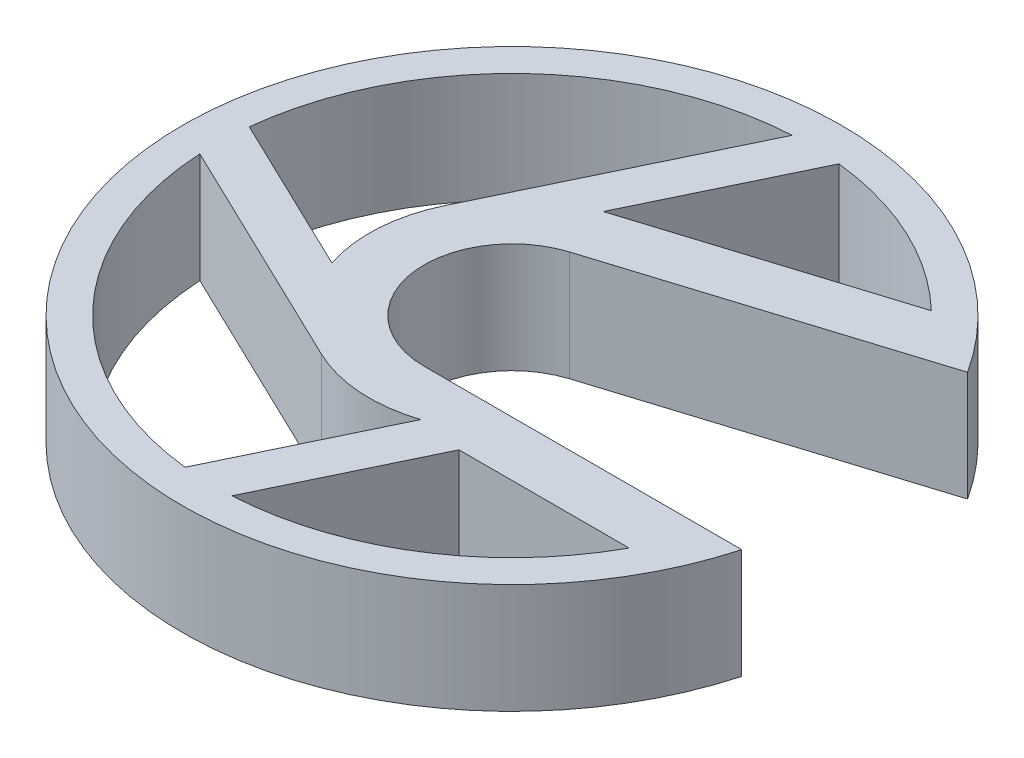
ISO-10303-21;
HEADER;
FILE_DESCRIPTION(('STEP AP214'),'2;1');
FILE_NAME('part.step','',(''),(''),'','','');
FILE_SCHEMA(('AUTOMOTIVE_DESIGN { 1 0 10303 214 1 1 1 1 }'));
ENDSEC;
DATA;
#1=APPLICATION_CONTEXT('core data for automotive mechanical design processes');
#2=APPLICATION_PROTOCOL_DEFINITION('international standard','automotive_design',2000,#1);
#3=PRODUCT_CONTEXT('',#1,'mechanical');
#4=PRODUCT('Part','Part','',(#3));
#5=PRODUCT_RELATED_PRODUCT_CATEGORY('part','',(#4));
#6=PRODUCT_DEFINITION_FORMATION('','',#4);
#7=PRODUCT_DEFINITION_CONTEXT('part definition',#1,'design');
#8=PRODUCT_DEFINITION('design','',#6,#7);
#9=PRODUCT_DEFINITION_SHAPE('','',#8);
#10=(LENGTH_UNIT() NAMED_UNIT(*) SI_UNIT(.MILLI.,.METRE.));
#11=(NAMED_UNIT(*) PLANE_ANGLE_UNIT() SI_UNIT($,.RADIAN.));
#12=(NAMED_UNIT(*) SI_UNIT($,.STERADIAN.) SOLID_ANGLE_UNIT());
#13=UNCERTAINTY_MEASURE_WITH_UNIT(LENGTH_MEASURE(1.E-05),#10,'distance_accuracy_value','');
#14=(GEOMETRIC_REPRESENTATION_CONTEXT(3) GLOBAL_UNCERTAINTY_ASSIGNED_CONTEXT((#13)) GLOBAL_UNIT_ASSIGNED_CONTEXT((#10,
#11,#12)) REPRESENTATION_CONTEXT('',''));
#15=CARTESIAN_POINT('',(0.,0.,0.));
#16=DIRECTION('',(0.,0.,1.));
#17=DIRECTION('',(1.,0.,0.));
#18=AXIS2_PLACEMENT_3D('',#15,#16,#17);
#19=CARTESIAN_POINT('',(-59.407,5.,0.));
#20=DIRECTION('',(0.,-1.,0.));
#21=DIRECTION('',(0.,0.,-1.));
#22=AXIS2_PLACEMENT_3D('',#19,#20,#21);
#23=CYLINDRICAL_SURFACE('',#22,6.5);
#24=CARTESIAN_POINT('',(-59.407,0.,0.));
#25=DIRECTION('',(0.,1.,0.));
#26=DIRECTION('',(0.,0.,1.));
#27=AXIS2_PLACEMENT_3D('',#24,#25,#26);
#28=CIRCLE('',#27,6.5);
#29=CARTESIAN_POINT('',(-65.2650191949915,0.,-2.81666666666666));
#30=VERTEX_POINT('',#29);
#31=CARTESIAN_POINT('',(-65.5841608543902,0.,2.02303825445523));
#32=VERTEX_POINT('',#31);
#33=EDGE_CURVE('E226',#30,#32,#28,.T.);
#34=ORIENTED_EDGE('',*,*,#33,.T.);
#35=DIRECTION('',(0.,-1.,0.));
#36=VECTOR('',#35,1.);
#37=CARTESIAN_POINT('',(-65.5841608543902,5.,2.02303825445523));
#38=LINE('',#37,#36);
#39=CARTESIAN_POINT('',(-65.5841608543902,5.,2.02303825445523));
#40=VERTEX_POINT('',#39);
#41=EDGE_CURVE('E11',#40,#32,#38,.T.);
#42=ORIENTED_EDGE('',*,*,#41,.F.);
#43=CARTESIAN_POINT('',(-59.407,5.,0.));
#44=DIRECTION('',(0.,1.,0.));
#45=DIRECTION('',(0.,0.,1.));
#46=AXIS2_PLACEMENT_3D('',#43,#44,#45);
#47=CIRCLE('',#46,6.5);
#48=CARTESIAN_POINT('',(-65.2650191949915,5.,-2.81666666666666));
#49=VERTEX_POINT('',#48);
#50=EDGE_CURVE('E189',#49,#40,#47,.T.);
#51=ORIENTED_EDGE('',*,*,#50,.F.);
#52=DIRECTION('',(0.,-1.,0.));
#53=VECTOR('',#52,1.);
#54=CARTESIAN_POINT('',(-65.2650191949915,5.,-2.81666666666666));
#55=LINE('',#54,#53);
#56=EDGE_CURVE('E55',#49,#30,#55,.T.);
#57=ORIENTED_EDGE('',*,*,#56,.T.);
#58=EDGE_LOOP('',(#34,#42,#51,#57));
#59=FACE_BOUND('',#58,.T.);
#60=ADVANCED_FACE('F36',(#59),#23,.T.);
#61=CARTESIAN_POINT('',(-13.1053144444444,5.,27.256041504836));
#62=DIRECTION('',(0.433333333333332,0.,-0.901233722306385));
#63=DIRECTION('',(-0.901233722306385,0.,-0.433333333333332));
#64=AXIS2_PLACEMENT_3D('',#61,#62,#63);
#65=PLANE('',#64);
#66=DIRECTION('',(0.901233722306386,0.,0.433333333333332));
#67=VECTOR('',#66,1.);
#68=CARTESIAN_POINT('',(-13.1053144444444,0.,27.256041504836));
#69=LINE('',#68,#67);
#70=CARTESIAN_POINT('',(-72.8278325765831,0.,-1.45988114287635));
#71=VERTEX_POINT('',#70);
#72=EDGE_CURVE('E179',#71,#32,#69,.T.);
#73=ORIENTED_EDGE('',*,*,#72,.F.);
#74=DIRECTION('',(0.,-1.,0.));
#75=VECTOR('',#74,1.);
#76=CARTESIAN_POINT('',(-72.8278325765831,5.,-1.45988114287635));
#77=LINE('',#76,#75);
#78=CARTESIAN_POINT('',(-72.8278325765831,5.,-1.45988114287635));
#79=VERTEX_POINT('',#78);
#80=EDGE_CURVE('E46',#79,#71,#77,.T.);
#81=ORIENTED_EDGE('',*,*,#80,.F.);
#82=DIRECTION('',(0.901233722306386,0.,0.433333333333332));
#83=VECTOR('',#82,1.);
#84=CARTESIAN_POINT('',(-13.1053144444444,5.,27.256041504836));
#85=LINE('',#84,#83);
#86=EDGE_CURVE('E177',#79,#40,#85,.T.);
#87=ORIENTED_EDGE('',*,*,#86,.T.);
#88=ORIENTED_EDGE('',*,*,#41,.T.);
#89=EDGE_LOOP('',(#73,#81,#87,#88));
#90=FACE_BOUND('',#89,.T.);
#91=ADVANCED_FACE('F176',(#90),#65,.T.);
#92=CARTESIAN_POINT('',(-59.407,5.,0.));
#93=DIRECTION('',(0.,-1.,0.));
#94=DIRECTION('',(0.,0.,-1.));
#95=AXIS2_PLACEMENT_3D('',#92,#93,#94);
#96=CYLINDRICAL_SURFACE('',#95,13.5);
#97=CARTESIAN_POINT('',(-59.407,0.,0.));
#98=DIRECTION('',(0.,1.,0.));
#99=DIRECTION('',(0.,0.,1.));
#100=AXIS2_PLACEMENT_3D('',#97,#98,#99);
#101=CIRCLE('',#100,13.5);
#102=CARTESIAN_POINT('',(-60.1377500496385,0.,-13.4802078754355));
#103=VERTEX_POINT('',#102);
#104=EDGE_CURVE('E243',#103,#71,#101,.T.);
#105=ORIENTED_EDGE('',*,*,#104,.F.);
#106=DIRECTION('',(0.,-1.,0.));
#107=VECTOR('',#106,1.);
#108=CARTESIAN_POINT('',(-60.1377500496385,5.,-13.4802078754355));
#109=LINE('',#108,#107);
#110=CARTESIAN_POINT('',(-60.1377500496385,5.,-13.4802078754355));
#111=VERTEX_POINT('',#110);
#112=EDGE_CURVE('E113',#111,#103,#109,.T.);
#113=ORIENTED_EDGE('',*,*,#112,.F.);
#114=CARTESIAN_POINT('',(-59.407,5.,0.));
#115=DIRECTION('',(0.,1.,0.));
#116=DIRECTION('',(0.,0.,1.));
#117=AXIS2_PLACEMENT_3D('',#114,#115,#116);
#118=CIRCLE('',#117,13.5);
#119=EDGE_CURVE('E188',#111,#79,#118,.T.);
#120=ORIENTED_EDGE('',*,*,#119,.T.);
#121=ORIENTED_EDGE('',*,*,#80,.T.);
#122=EDGE_LOOP('',(#105,#113,#120,#121));
#123=FACE_BOUND('',#122,.T.);
#124=ADVANCED_FACE('F192',(#123),#96,.F.);
#125=CARTESIAN_POINT('',(-7.23473802794314,5.,-23.1295921873866));
#126=DIRECTION('',(-0.298528370942468,0.,-0.954400760552105));
#127=DIRECTION('',(-0.954400760552105,0.,0.298528370942468));
#128=AXIS2_PLACEMENT_3D('',#125,#126,#127);
#129=PLANE('',#128);
#130=DIRECTION('',(0.954400760552105,0.,-0.298528370942468));
#131=VECTOR('',#130,1.);
#132=CARTESIAN_POINT('',(-7.23473802794314,0.,-23.1295921873866));
#133=LINE('',#132,#131);
#134=CARTESIAN_POINT('',(-61.347434411126,0.,-6.20360494358868));
#135=VERTEX_POINT('',#134);
#136=CARTESIAN_POINT('',(-50.0548123221716,0.,-9.73584026361747));
#137=VERTEX_POINT('',#136);
#138=EDGE_CURVE('E233',#135,#137,#133,.T.);
#139=ORIENTED_EDGE('',*,*,#138,.F.);
#140=DIRECTION('',(0.,-1.,0.));
#141=VECTOR('',#140,1.);
#142=CARTESIAN_POINT('',(-61.347434411126,5.,-6.20360494358868));
#143=LINE('',#142,#141);
#144=CARTESIAN_POINT('',(-61.347434411126,5.,-6.20360494358868));
#145=VERTEX_POINT('',#144);
#146=EDGE_CURVE('E249',#145,#135,#143,.T.);
#147=ORIENTED_EDGE('',*,*,#146,.F.);
#148=DIRECTION('',(0.954400760552105,0.,-0.298528370942468));
#149=VECTOR('',#148,1.);
#150=CARTESIAN_POINT('',(-7.23473802794314,5.,-23.1295921873866));
#151=LINE('',#150,#149);
#152=CARTESIAN_POINT('',(-50.0548123221716,5.,-9.73584026361747));
#153=VERTEX_POINT('',#152);
#154=EDGE_CURVE('E324',#145,#153,#151,.T.);
#155=ORIENTED_EDGE('',*,*,#154,.T.);
#156=DIRECTION('',(0.,-1.,0.));
#157=VECTOR('',#156,1.);
#158=CARTESIAN_POINT('',(-50.0548123221716,5.,-9.73584026361747));
#159=LINE('',#158,#157);
#160=EDGE_CURVE('E251',#153,#137,#159,.T.);
#161=ORIENTED_EDGE('',*,*,#160,.T.);
#162=EDGE_LOOP('',(#139,#147,#155,#161));
#163=FACE_BOUND('',#162,.T.);
#164=ADVANCED_FACE('F351',(#163),#129,.T.);
#165=CARTESIAN_POINT('',(-61.4300382544552,0.,-6.17716085439021));
#166=VERTEX_POINT('',#165);
#167=EDGE_CURVE('E227',#135,#166,#28,.T.);
#168=ORIENTED_EDGE('',*,*,#167,.T.);
#169=DIRECTION('',(0.,-1.,0.));
#170=VECTOR('',#169,1.);
#171=CARTESIAN_POINT('',(-61.4300382544552,5.,-6.17716085439021));
#172=LINE('',#171,#170);
#173=CARTESIAN_POINT('',(-61.4300382544552,5.,-6.17716085439021));
#174=VERTEX_POINT('',#173);
#175=EDGE_CURVE('E256',#174,#166,#172,.T.);
#176=ORIENTED_EDGE('',*,*,#175,.F.);
#177=EDGE_CURVE('E318',#145,#174,#47,.T.);
#178=ORIENTED_EDGE('',*,*,#177,.F.);
#179=ORIENTED_EDGE('',*,*,#146,.T.);
#180=EDGE_LOOP('',(#168,#176,#178,#179));
#181=FACE_BOUND('',#180,.T.);
#182=ADVANCED_FACE('F340',(#181),#23,.T.);
#183=CARTESIAN_POINT('',(-52.3072373059343,5.,-25.1504897544573));
#184=DIRECTION('',(0.901233722306385,0.,0.433333333333333));
#185=DIRECTION('',(0.433333333333333,0.,-0.901233722306385));
#186=AXIS2_PLACEMENT_3D('',#183,#184,#185);
#187=PLANE('',#186);
#188=DIRECTION('',(-0.433333333333333,0.,0.901233722306385));
#189=VECTOR('',#188,1.);
#190=CARTESIAN_POINT('',(-52.3072373059343,0.,-25.1504897544573));
#191=LINE('',#190,#189);
#192=CARTESIAN_POINT('',(-57.9471188571237,0.,-13.4208325765831));
#193=VERTEX_POINT('',#192);
#194=EDGE_CURVE('E236',#193,#166,#191,.T.);
#195=ORIENTED_EDGE('',*,*,#194,.F.);
#196=DIRECTION('',(0.,-1.,0.));
#197=VECTOR('',#196,1.);
#198=CARTESIAN_POINT('',(-57.9471188571237,5.,-13.4208325765831));
#199=LINE('',#198,#197);
#200=CARTESIAN_POINT('',(-57.9471188571237,5.,-13.4208325765831));
#201=VERTEX_POINT('',#200);
#202=EDGE_CURVE('E253',#201,#193,#199,.T.);
#203=ORIENTED_EDGE('',*,*,#202,.F.);
#204=DIRECTION('',(-0.433333333333333,0.,0.901233722306385));
#205=VECTOR('',#204,1.);
#206=CARTESIAN_POINT('',(-52.3072373059343,5.,-25.1504897544573));
#207=LINE('',#206,#205);
#208=EDGE_CURVE('E327',#201,#174,#207,.T.);
#209=ORIENTED_EDGE('',*,*,#208,.T.);
#210=ORIENTED_EDGE('',*,*,#175,.T.);
#211=EDGE_LOOP('',(#195,#203,#209,#210));
#212=FACE_BOUND('',#211,.T.);
#213=ADVANCED_FACE('F344',(#212),#187,.T.);
#214=CARTESIAN_POINT('',(-13.9719811111111,5.,29.0585089494489));
#215=DIRECTION('',(-0.433333333333334,0.,0.901233722306385));
#216=DIRECTION('',(0.901233722306385,0.,0.433333333333334));
#217=AXIS2_PLACEMENT_3D('',#214,#215,#216);
#218=PLANE('',#217);
#219=DIRECTION('',(-0.901233722306385,0.,-0.433333333333334));
#220=VECTOR('',#219,1.);
#221=CARTESIAN_POINT('',(-13.9719811111111,0.,29.0585089494489));
#222=LINE('',#221,#220);
#223=CARTESIAN_POINT('',(-62.2236666666667,0.,5.85801919499151));
#224=VERTEX_POINT('',#223);
#225=CARTESIAN_POINT('',(-72.8872078754355,0.,0.730750049638505));
#226=VERTEX_POINT('',#225);
#227=EDGE_CURVE('E219',#224,#226,#222,.T.);
#228=ORIENTED_EDGE('',*,*,#227,.F.);
#229=DIRECTION('',(0.,-1.,0.));
#230=VECTOR('',#229,1.);
#231=CARTESIAN_POINT('',(-62.2236666666667,5.,5.85801919499151));
#232=LINE('',#231,#230);
#233=CARTESIAN_POINT('',(-62.2236666666667,5.,5.85801919499151));
#234=VERTEX_POINT('',#233);
#235=EDGE_CURVE('E254',#234,#224,#232,.T.);
#236=ORIENTED_EDGE('',*,*,#235,.F.);
#237=DIRECTION('',(-0.901233722306385,0.,-0.433333333333334));
#238=VECTOR('',#237,1.);
#239=CARTESIAN_POINT('',(-13.9719811111111,5.,29.0585089494489));
#240=LINE('',#239,#238);
#241=CARTESIAN_POINT('',(-72.8872078754355,5.,0.730750049638505));
#242=VERTEX_POINT('',#241);
#243=EDGE_CURVE('E312',#234,#242,#240,.T.);
#244=ORIENTED_EDGE('',*,*,#243,.T.);
#245=DIRECTION('',(0.,-1.,0.));
#246=VECTOR('',#245,1.);
#247=CARTESIAN_POINT('',(-72.8872078754355,5.,0.730750049638505));
#248=LINE('',#247,#246);
#249=EDGE_CURVE('E259',#242,#226,#248,.T.);
#250=ORIENTED_EDGE('',*,*,#249,.T.);
#251=EDGE_LOOP('',(#228,#236,#244,#250));
#252=FACE_BOUND('',#251,.T.);
#253=ADVANCED_FACE('F371',(#252),#218,.T.);
#254=CARTESIAN_POINT('',(-57.3839617455447,0.,6.1771608543902));
#255=VERTEX_POINT('',#254);
#256=EDGE_CURVE('E222',#224,#255,#28,.T.);
#257=ORIENTED_EDGE('',*,*,#256,.T.);
#258=DIRECTION('',(0.,-1.,0.));
#259=VECTOR('',#258,1.);
#260=CARTESIAN_POINT('',(-57.3839617455447,5.,6.1771608543902));
#261=LINE('',#260,#259);
#262=CARTESIAN_POINT('',(-57.3839617455447,5.,6.1771608543902));
#263=VERTEX_POINT('',#262);
#264=EDGE_CURVE('E264',#263,#255,#261,.T.);
#265=ORIENTED_EDGE('',*,*,#264,.F.);
#266=EDGE_CURVE('E315',#234,#263,#47,.T.);
#267=ORIENTED_EDGE('',*,*,#266,.F.);
#268=ORIENTED_EDGE('',*,*,#235,.T.);
#269=EDGE_LOOP('',(#257,#265,#267,#268));
#270=FACE_BOUND('',#269,.T.);
#271=ADVANCED_FACE('F359',(#270),#23,.T.);
#272=CARTESIAN_POINT('',(-44.1961338051768,5.,-21.2504897544573));
#273=DIRECTION('',(-0.901233722306385,0.,-0.433333333333333));
#274=DIRECTION('',(-0.433333333333333,0.,0.901233722306385));
#275=AXIS2_PLACEMENT_3D('',#272,#273,#274);
#276=PLANE('',#275);
#277=DIRECTION('',(0.433333333333333,0.,-0.901233722306385));
#278=VECTOR('',#277,1.);
#279=CARTESIAN_POINT('',(-44.1961338051768,0.,-21.2504897544573));
#280=LINE('',#279,#278);
#281=CARTESIAN_POINT('',(-60.8668811428763,0.,13.4208325765831));
#282=VERTEX_POINT('',#281);
#283=EDGE_CURVE('E225',#282,#255,#280,.T.);
#284=ORIENTED_EDGE('',*,*,#283,.F.);
#285=DIRECTION('',(0.,-1.,0.));
#286=VECTOR('',#285,1.);
#287=CARTESIAN_POINT('',(-60.8668811428763,5.,13.4208325765831));
#288=LINE('',#287,#286);
#289=CARTESIAN_POINT('',(-60.8668811428763,5.,13.4208325765831));
#290=VERTEX_POINT('',#289);
#291=EDGE_CURVE('E261',#290,#282,#288,.T.);
#292=ORIENTED_EDGE('',*,*,#291,.F.);
#293=DIRECTION('',(0.433333333333333,0.,-0.901233722306385));
#294=VECTOR('',#293,1.);
#295=CARTESIAN_POINT('',(-44.1961338051768,5.,-21.2504897544573));
#296=LINE('',#295,#294);
#297=EDGE_CURVE('E317',#290,#263,#296,.T.);
#298=ORIENTED_EDGE('',*,*,#297,.T.);
#299=ORIENTED_EDGE('',*,*,#264,.T.);
#300=EDGE_LOOP('',(#284,#292,#298,#299));
#301=FACE_BOUND('',#300,.T.);
#302=ADVANCED_FACE('F370',(#301),#276,.T.);
#303=CARTESIAN_POINT('',(-59.407,5.,0.));
#304=DIRECTION('',(0.,-1.,0.));
#305=DIRECTION('',(0.,0.,-1.));
#306=AXIS2_PLACEMENT_3D('',#303,#304,#305);
#307=CYLINDRICAL_SURFACE('',#306,13.5);
#308=CARTESIAN_POINT('',(-59.407,0.,0.));
#309=DIRECTION('',(0.,1.,0.));
#310=DIRECTION('',(0.,0.,1.));
#311=AXIS2_PLACEMENT_3D('',#308,#309,#310);
#312=CIRCLE('',#311,13.5);
#313=CARTESIAN_POINT('',(-58.6762499503615,0.,13.4802078754355));
#314=VERTEX_POINT('',#313);
#315=CARTESIAN_POINT('',(-47.5748404338008,0.,6.5));
#316=VERTEX_POINT('',#315);
#317=EDGE_CURVE('E210',#314,#316,#312,.T.);
#318=ORIENTED_EDGE('',*,*,#317,.F.);
#319=DIRECTION('',(0.,-1.,0.));
#320=VECTOR('',#319,1.);
#321=CARTESIAN_POINT('',(-58.6762499503615,5.,13.4802078754355));
#322=LINE('',#321,#320);
#323=CARTESIAN_POINT('',(-58.6762499503615,5.,13.4802078754355));
#324=VERTEX_POINT('',#323);
#325=EDGE_CURVE('E262',#324,#314,#322,.T.);
#326=ORIENTED_EDGE('',*,*,#325,.F.);
#327=CARTESIAN_POINT('',(-59.407,5.,0.));
#328=DIRECTION('',(0.,1.,0.));
#329=DIRECTION('',(0.,0.,1.));
#330=AXIS2_PLACEMENT_3D('',#327,#328,#329);
#331=CIRCLE('',#330,13.5);
#332=CARTESIAN_POINT('',(-47.5748404338008,5.,6.5));
#333=VERTEX_POINT('',#332);
#334=EDGE_CURVE('E298',#324,#333,#331,.T.);
#335=ORIENTED_EDGE('',*,*,#334,.T.);
#336=DIRECTION('',(0.,-1.,0.));
#337=VECTOR('',#336,1.);
#338=CARTESIAN_POINT('',(-47.5748404338008,5.,6.5));
#339=LINE('',#338,#337);
#340=EDGE_CURVE('E267',#333,#316,#339,.T.);
#341=ORIENTED_EDGE('',*,*,#340,.T.);
#342=EDGE_LOOP('',(#318,#326,#335,#341));
#343=FACE_BOUND('',#342,.T.);
#344=ADVANCED_FACE('F377',(#343),#307,.F.);
#345=CARTESIAN_POINT('',(-42.3936663605641,5.,-20.3838230877907));
#346=DIRECTION('',(0.901233722306385,0.,0.433333333333333));
#347=DIRECTION('',(0.433333333333333,0.,-0.901233722306385));
#348=AXIS2_PLACEMENT_3D('',#345,#346,#347);
#349=PLANE('',#348);
#350=DIRECTION('',(-0.433333333333333,0.,0.901233722306385));
#351=VECTOR('',#350,1.);
#352=CARTESIAN_POINT('',(-42.3936663605641,0.,-20.3838230877907));
#353=LINE('',#352,#351);
#354=CARTESIAN_POINT('',(-55.3200098639594,0.,6.5));
#355=VERTEX_POINT('',#354);
#356=EDGE_CURVE('E213',#355,#314,#353,.T.);
#357=ORIENTED_EDGE('',*,*,#356,.F.);
#358=DIRECTION('',(0.,-1.,0.));
#359=VECTOR('',#358,1.);
#360=CARTESIAN_POINT('',(-55.3200098639594,5.,6.5));
#361=LINE('',#360,#359);
#362=CARTESIAN_POINT('',(-55.3200098639594,5.,6.5));
#363=VERTEX_POINT('',#362);
#364=EDGE_CURVE('E269',#363,#355,#361,.T.);
#365=ORIENTED_EDGE('',*,*,#364,.F.);
#366=DIRECTION('',(-0.433333333333333,0.,0.901233722306385));
#367=VECTOR('',#366,1.);
#368=CARTESIAN_POINT('',(-42.3936663605641,5.,-20.3838230877907));
#369=LINE('',#368,#367);
#370=EDGE_CURVE('E307',#363,#324,#369,.T.);
#371=ORIENTED_EDGE('',*,*,#370,.T.);
#372=ORIENTED_EDGE('',*,*,#325,.T.);
#373=EDGE_LOOP('',(#357,#365,#371,#372));
#374=FACE_BOUND('',#373,.T.);
#375=ADVANCED_FACE('F404',(#374),#349,.T.);
#376=CARTESIAN_POINT('',(-59.407,5.,0.));
#377=DIRECTION('',(0.,-1.,0.));
#378=DIRECTION('',(0.,0.,-1.));
#379=AXIS2_PLACEMENT_3D('',#376,#377,#378);
#380=CYLINDRICAL_SURFACE('',#379,15.);
#381=CARTESIAN_POINT('',(-59.407,0.,0.));
#382=DIRECTION('',(0.,1.,0.));
#383=DIRECTION('',(0.,0.,1.));
#384=AXIS2_PLACEMENT_3D('',#381,#382,#383);
#385=CIRCLE('',#384,15.);
#386=CARTESIAN_POINT('',(-46.8035017464376,0.,-8.13337763616382));
#387=VERTEX_POINT('',#386);
#388=CARTESIAN_POINT('',(-44.950167705199,0.,4.00000000000001));
#389=VERTEX_POINT('',#388);
#390=EDGE_CURVE('E199',#387,#389,#385,.T.);
#391=ORIENTED_EDGE('',*,*,#390,.T.);
#392=DIRECTION('',(0.,-1.,0.));
#393=VECTOR('',#392,1.);
#394=CARTESIAN_POINT('',(-44.950167705199,5.,4.00000000000001));
#395=LINE('',#394,#393);
#396=CARTESIAN_POINT('',(-44.950167705199,5.,4.00000000000001));
#397=VERTEX_POINT('',#396);
#398=EDGE_CURVE('E40',#397,#389,#395,.T.);
#399=ORIENTED_EDGE('',*,*,#398,.F.);
#400=CARTESIAN_POINT('',(-59.407,5.,0.));
#401=DIRECTION('',(0.,1.,0.));
#402=DIRECTION('',(0.,0.,1.));
#403=AXIS2_PLACEMENT_3D('',#400,#401,#402);
#404=CIRCLE('',#403,15.);
#405=CARTESIAN_POINT('',(-46.8035017464376,5.,-8.13337763616382));
#406=VERTEX_POINT('',#405);
#407=EDGE_CURVE('E126',#406,#397,#404,.T.);
#408=ORIENTED_EDGE('',*,*,#407,.F.);
#409=DIRECTION('',(0.,-1.,0.));
#410=VECTOR('',#409,1.);
#411=CARTESIAN_POINT('',(-46.8035017464376,5.,-8.13337763616382));
#412=LINE('',#411,#410);
#413=EDGE_CURVE('E195',#406,#387,#412,.T.);
#414=ORIENTED_EDGE('',*,*,#413,.T.);
#415=EDGE_LOOP('',(#391,#399,#408,#414));
#416=FACE_BOUND('',#415,.T.);
#417=ADVANCED_FACE('F38',(#416),#380,.T.);
#418=CARTESIAN_POINT('',(0.,5.,4.00000000000001));
#419=DIRECTION('',(0.,0.,-1.));
#420=DIRECTION('',(-1.,0.,0.));
#421=AXIS2_PLACEMENT_3D('',#418,#419,#420);
#422=PLANE('',#421);
#423=DIRECTION('',(1.,0.,0.));
#424=VECTOR('',#423,1.);
#425=CARTESIAN_POINT('',(0.,0.,4.00000000000001));
#426=LINE('',#425,#424);
#427=CARTESIAN_POINT('',(-59.407,0.,4.00000000000001));
#428=VERTEX_POINT('',#427);
#429=EDGE_CURVE('E202',#428,#389,#426,.T.);
#430=ORIENTED_EDGE('',*,*,#429,.F.);
#431=DIRECTION('',(0.,-1.,0.));
#432=VECTOR('',#431,1.);
#433=CARTESIAN_POINT('',(-59.407,5.,4.00000000000001));
#434=LINE('',#433,#432);
#435=CARTESIAN_POINT('',(-59.407,5.,4.00000000000001));
#436=VERTEX_POINT('',#435);
#437=EDGE_CURVE('E275',#436,#428,#434,.T.);
#438=ORIENTED_EDGE('',*,*,#437,.F.);
#439=DIRECTION('',(1.,0.,0.));
#440=VECTOR('',#439,1.);
#441=CARTESIAN_POINT('',(0.,5.,4.00000000000001));
#442=LINE('',#441,#440);
#443=EDGE_CURVE('E283',#436,#397,#442,.T.);
#444=ORIENTED_EDGE('',*,*,#443,.T.);
#445=ORIENTED_EDGE('',*,*,#398,.T.);
#446=EDGE_LOOP('',(#430,#438,#444,#445));
#447=FACE_BOUND('',#446,.T.);
#448=ADVANCED_FACE('F282',(#447),#422,.T.);
#449=CARTESIAN_POINT('',(-59.407,5.,0.));
#450=DIRECTION('',(0.,-1.,0.));
#451=DIRECTION('',(0.,0.,-1.));
#452=AXIS2_PLACEMENT_3D('',#449,#450,#451);
#453=CYLINDRICAL_SURFACE('',#452,4.00000000000001);
#454=CARTESIAN_POINT('',(-59.407,0.,0.));
#455=DIRECTION('',(0.,1.,0.));
#456=DIRECTION('',(0.,0.,1.));
#457=AXIS2_PLACEMENT_3D('',#454,#455,#456);
#458=CIRCLE('',#457,4.00000000000001);
#459=CARTESIAN_POINT('',(-60.6011134837699,0.,-3.81760304220843));
#460=VERTEX_POINT('',#459);
#461=EDGE_CURVE('E205',#460,#428,#458,.T.);
#462=ORIENTED_EDGE('',*,*,#461,.F.);
#463=DIRECTION('',(0.,-1.,0.));
#464=VECTOR('',#463,1.);
#465=CARTESIAN_POINT('',(-60.6011134837699,5.,-3.81760304220843));
#466=LINE('',#465,#464);
#467=CARTESIAN_POINT('',(-60.6011134837699,5.,-3.81760304220843));
#468=VERTEX_POINT('',#467);
#469=EDGE_CURVE('E274',#468,#460,#466,.T.);
#470=ORIENTED_EDGE('',*,*,#469,.F.);
#471=CARTESIAN_POINT('',(-59.407,5.,0.));
#472=DIRECTION('',(0.,1.,0.));
#473=DIRECTION('',(0.,0.,1.));
#474=AXIS2_PLACEMENT_3D('',#471,#472,#473);
#475=CIRCLE('',#474,4.00000000000001);
#476=EDGE_CURVE('E294',#468,#436,#475,.T.);
#477=ORIENTED_EDGE('',*,*,#476,.T.);
#478=ORIENTED_EDGE('',*,*,#437,.T.);
#479=EDGE_LOOP('',(#462,#470,#477,#478));
#480=FACE_BOUND('',#479,.T.);
#481=ADVANCED_FACE('F291',(#480),#453,.F.);
#482=CARTESIAN_POINT('',(-59.407,5.,0.));
#483=DIRECTION('',(0.,-1.,0.));
#484=DIRECTION('',(0.,0.,-1.));
#485=AXIS2_PLACEMENT_3D('',#482,#483,#484);
#486=CYLINDRICAL_SURFACE('',#485,13.5);
#487=CARTESIAN_POINT('',(-59.407,0.,0.));
#488=DIRECTION('',(0.,1.,0.));
#489=DIRECTION('',(0.,0.,1.));
#490=AXIS2_PLACEMENT_3D('',#487,#488,#489);
#491=CIRCLE('',#490,13.5);
#492=EDGE_CURVE('E239',#137,#193,#491,.T.);
#493=ORIENTED_EDGE('',*,*,#492,.F.);
#494=ORIENTED_EDGE('',*,*,#160,.F.);
#495=CARTESIAN_POINT('',(-59.407,5.,0.));
#496=DIRECTION('',(0.,1.,0.));
#497=DIRECTION('',(0.,0.,1.));
#498=AXIS2_PLACEMENT_3D('',#495,#496,#497);
#499=CIRCLE('',#498,13.5);
#500=EDGE_CURVE('E329',#153,#201,#499,.T.);
#501=ORIENTED_EDGE('',*,*,#500,.T.);
#502=ORIENTED_EDGE('',*,*,#202,.T.);
#503=EDGE_LOOP('',(#493,#494,#501,#502));
#504=FACE_BOUND('',#503,.T.);
#505=ADVANCED_FACE('F346',(#504),#486,.F.);
#506=CARTESIAN_POINT('',(-59.407,5.,0.));
#507=DIRECTION('',(0.,-1.,0.));
#508=DIRECTION('',(0.,0.,-1.));
#509=AXIS2_PLACEMENT_3D('',#506,#507,#508);
#510=CYLINDRICAL_SURFACE('',#509,13.5);
#511=CARTESIAN_POINT('',(-59.407,0.,0.));
#512=DIRECTION('',(0.,1.,0.));
#513=DIRECTION('',(0.,0.,1.));
#514=AXIS2_PLACEMENT_3D('',#511,#512,#513);
#515=CIRCLE('',#514,13.5);
#516=EDGE_CURVE('E230',#226,#282,#515,.T.);
#517=ORIENTED_EDGE('',*,*,#516,.F.);
#518=ORIENTED_EDGE('',*,*,#249,.F.);
#519=CARTESIAN_POINT('',(-59.407,5.,0.));
#520=DIRECTION('',(0.,1.,0.));
#521=DIRECTION('',(0.,0.,1.));
#522=AXIS2_PLACEMENT_3D('',#519,#520,#521);
#523=CIRCLE('',#522,13.5);
#524=EDGE_CURVE('E321',#242,#290,#523,.T.);
#525=ORIENTED_EDGE('',*,*,#524,.T.);
#526=ORIENTED_EDGE('',*,*,#291,.T.);
#527=EDGE_LOOP('',(#517,#518,#525,#526));
#528=FACE_BOUND('',#527,.T.);
#529=ADVANCED_FACE('F394',(#528),#510,.F.);
#530=CARTESIAN_POINT('',(0.,5.,6.5));
#531=DIRECTION('',(0.,0.,-1.));
#532=DIRECTION('',(-1.,0.,0.));
#533=AXIS2_PLACEMENT_3D('',#530,#531,#532);
#534=PLANE('',#533);
#535=DIRECTION('',(1.,0.,0.));
#536=VECTOR('',#535,1.);
#537=CARTESIAN_POINT('',(0.,0.,6.5));
#538=LINE('',#537,#536);
#539=EDGE_CURVE('E216',#355,#316,#538,.T.);
#540=ORIENTED_EDGE('',*,*,#539,.T.);
#541=ORIENTED_EDGE('',*,*,#340,.F.);
#542=DIRECTION('',(1.,0.,0.));
#543=VECTOR('',#542,1.);
#544=CARTESIAN_POINT('',(0.,5.,6.5));
#545=LINE('',#544,#543);
#546=EDGE_CURVE('E310',#363,#333,#545,.T.);
#547=ORIENTED_EDGE('',*,*,#546,.F.);
#548=ORIENTED_EDGE('',*,*,#364,.T.);
#549=EDGE_LOOP('',(#540,#541,#547,#548));
#550=FACE_BOUND('',#549,.T.);
#551=ADVANCED_FACE('F396',(#550),#534,.F.);
#552=CARTESIAN_POINT('',(-6.48841710058697,5.,-20.7435902860064));
#553=DIRECTION('',(-0.298528370942468,0.,-0.954400760552105));
#554=DIRECTION('',(-0.954400760552105,0.,0.298528370942468));
#555=AXIS2_PLACEMENT_3D('',#552,#553,#554);
#556=PLANE('',#555);
#557=DIRECTION('',(0.954400760552105,0.,-0.298528370942468));
#558=VECTOR('',#557,1.);
#559=CARTESIAN_POINT('',(-6.48841710058697,0.,-20.7435902860064));
#560=LINE('',#559,#558);
#561=EDGE_CURVE('E208',#460,#387,#560,.T.);
#562=ORIENTED_EDGE('',*,*,#561,.T.);
#563=ORIENTED_EDGE('',*,*,#413,.F.);
#564=DIRECTION('',(0.954400760552105,0.,-0.298528370942468));
#565=VECTOR('',#564,1.);
#566=CARTESIAN_POINT('',(-6.48841710058697,5.,-20.7435902860064));
#567=LINE('',#566,#565);
#568=EDGE_CURVE('E296',#468,#406,#567,.T.);
#569=ORIENTED_EDGE('',*,*,#568,.F.);
#570=ORIENTED_EDGE('',*,*,#469,.T.);
#571=EDGE_LOOP('',(#562,#563,#569,#570));
#572=FACE_BOUND('',#571,.T.);
#573=ADVANCED_FACE('F297',(#572),#556,.F.);
#574=CARTESIAN_POINT('',(-54.1097047505471,5.,-26.017156421124));
#575=DIRECTION('',(-0.901233722306385,0.,-0.433333333333334));
#576=DIRECTION('',(-0.433333333333334,0.,0.901233722306385));
#577=AXIS2_PLACEMENT_3D('',#574,#575,#576);
#578=PLANE('',#577);
#579=DIRECTION('',(0.433333333333334,0.,-0.901233722306385));
#580=VECTOR('',#579,1.);
#581=CARTESIAN_POINT('',(-54.1097047505471,0.,-26.017156421124));
#582=LINE('',#581,#580);
#583=EDGE_CURVE('E245',#30,#103,#582,.T.);
#584=ORIENTED_EDGE('',*,*,#583,.F.);
#585=ORIENTED_EDGE('',*,*,#56,.F.);
#586=DIRECTION('',(0.433333333333334,0.,-0.901233722306385));
#587=VECTOR('',#586,1.);
#588=CARTESIAN_POINT('',(-54.1097047505471,5.,-26.017156421124));
#589=LINE('',#588,#587);
#590=EDGE_CURVE('E193',#49,#111,#589,.T.);
#591=ORIENTED_EDGE('',*,*,#590,.T.);
#592=ORIENTED_EDGE('',*,*,#112,.T.);
#593=EDGE_LOOP('',(#584,#585,#591,#592));
#594=FACE_BOUND('',#593,.T.);
#595=ADVANCED_FACE('F413',(#594),#578,.T.);
#596=CARTESIAN_POINT('',(0.,5.,0.));
#597=DIRECTION('',(0.,1.,0.));
#598=DIRECTION('',(0.,0.,1.));
#599=AXIS2_PLACEMENT_3D('',#596,#597,#598);
#600=PLANE('',#599);
#601=ORIENTED_EDGE('',*,*,#407,.T.);
#602=ORIENTED_EDGE('',*,*,#443,.F.);
#603=ORIENTED_EDGE('',*,*,#476,.F.);
#604=ORIENTED_EDGE('',*,*,#568,.T.);
#605=EDGE_LOOP('',(#601,#602,#603,#604));
#606=FACE_BOUND('',#605,.T.);
#607=ORIENTED_EDGE('',*,*,#334,.F.);
#608=ORIENTED_EDGE('',*,*,#370,.F.);
#609=ORIENTED_EDGE('',*,*,#546,.T.);
#610=EDGE_LOOP('',(#607,#608,#609));
#611=FACE_BOUND('',#610,.T.);
#612=ORIENTED_EDGE('',*,*,#243,.F.);
#613=ORIENTED_EDGE('',*,*,#266,.T.);
#614=ORIENTED_EDGE('',*,*,#297,.F.);
#615=ORIENTED_EDGE('',*,*,#524,.F.);
#616=EDGE_LOOP('',(#612,#613,#614,#615));
#617=FACE_BOUND('',#616,.T.);
#618=ORIENTED_EDGE('',*,*,#154,.F.);
#619=ORIENTED_EDGE('',*,*,#177,.T.);
#620=ORIENTED_EDGE('',*,*,#208,.F.);
#621=ORIENTED_EDGE('',*,*,#500,.F.);
#622=EDGE_LOOP('',(#618,#619,#620,#621));
#623=FACE_BOUND('',#622,.T.);
#624=ORIENTED_EDGE('',*,*,#50,.T.);
#625=ORIENTED_EDGE('',*,*,#86,.F.);
#626=ORIENTED_EDGE('',*,*,#119,.F.);
#627=ORIENTED_EDGE('',*,*,#590,.F.);
#628=EDGE_LOOP('',(#624,#625,#626,#627));
#629=FACE_BOUND('',#628,.T.);
#630=ADVANCED_FACE('F186',(#606,#611,#617,#623,#629),#600,.T.);
#631=CARTESIAN_POINT('',(0.,0.,0.));
#632=DIRECTION('',(0.,1.,0.));
#633=DIRECTION('',(0.,0.,1.));
#634=AXIS2_PLACEMENT_3D('',#631,#632,#633);
#635=PLANE('',#634);
#636=ORIENTED_EDGE('',*,*,#390,.F.);
#637=ORIENTED_EDGE('',*,*,#561,.F.);
#638=ORIENTED_EDGE('',*,*,#461,.T.);
#639=ORIENTED_EDGE('',*,*,#429,.T.);
#640=EDGE_LOOP('',(#636,#637,#638,#639));
#641=FACE_BOUND('',#640,.T.);
#642=ORIENTED_EDGE('',*,*,#317,.T.);
#643=ORIENTED_EDGE('',*,*,#539,.F.);
#644=ORIENTED_EDGE('',*,*,#356,.T.);
#645=EDGE_LOOP('',(#642,#643,#644));
#646=FACE_BOUND('',#645,.T.);
#647=ORIENTED_EDGE('',*,*,#227,.T.);
#648=ORIENTED_EDGE('',*,*,#516,.T.);
#649=ORIENTED_EDGE('',*,*,#283,.T.);
#650=ORIENTED_EDGE('',*,*,#256,.F.);
#651=EDGE_LOOP('',(#647,#648,#649,#650));
#652=FACE_BOUND('',#651,.T.);
#653=ORIENTED_EDGE('',*,*,#138,.T.);
#654=ORIENTED_EDGE('',*,*,#492,.T.);
#655=ORIENTED_EDGE('',*,*,#194,.T.);
#656=ORIENTED_EDGE('',*,*,#167,.F.);
#657=EDGE_LOOP('',(#653,#654,#655,#656));
#658=FACE_BOUND('',#657,.T.);
#659=ORIENTED_EDGE('',*,*,#33,.F.);
#660=ORIENTED_EDGE('',*,*,#583,.T.);
#661=ORIENTED_EDGE('',*,*,#104,.T.);
#662=ORIENTED_EDGE('',*,*,#72,.T.);
#663=EDGE_LOOP('',(#659,#660,#661,#662));
#664=FACE_BOUND('',#663,.T.);
#665=ADVANCED_FACE('F289',(#641,#646,#652,#658,#664),#635,.F.);
#666=CLOSED_SHELL('',(#60,#91,#124,#164,#182,#213,#253,#271,#302,#344,#375,#417,#448,#481,#505,
#529,#551,#573,#595,#630,#665));
#667=MANIFOLD_SOLID_BREP('B2',#666);
#668=ADVANCED_BREP_SHAPE_REPRESENTATION('',(#18,#667),#14);
#669=SHAPE_DEFINITION_REPRESENTATION(#9,#668);
ENDSEC;
END-ISO-10303-21;
